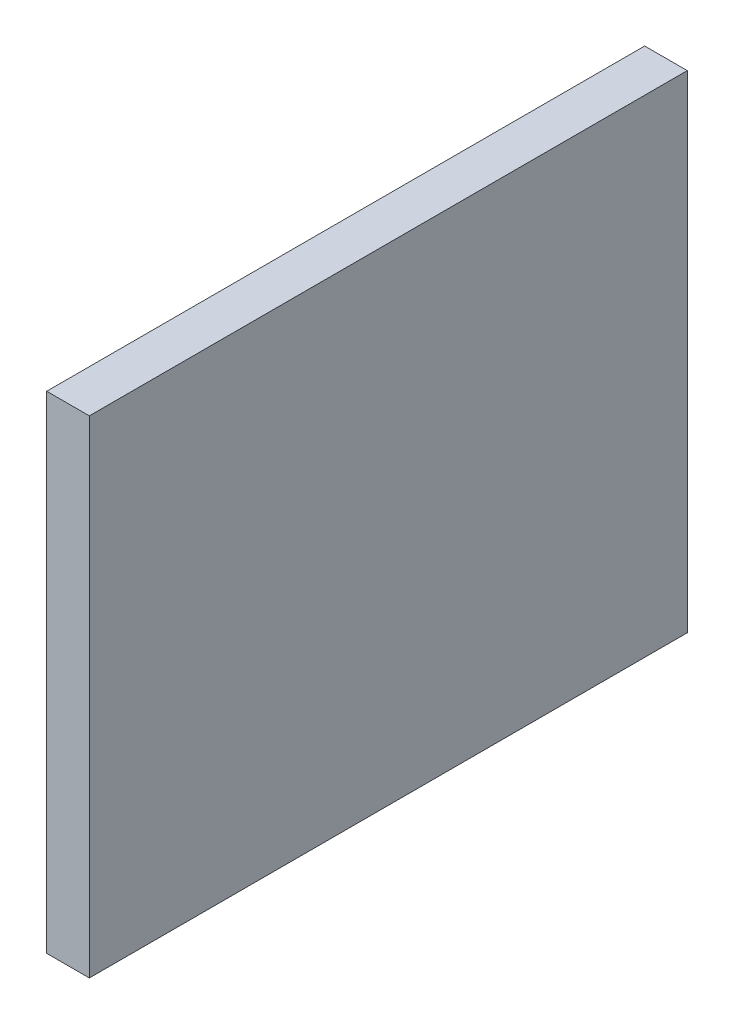
ISO-10303-21;
HEADER;
FILE_DESCRIPTION(('STEP AP214'),'2;1');
FILE_NAME('part.step','',(''),(''),'','','');
FILE_SCHEMA(('AUTOMOTIVE_DESIGN { 1 0 10303 214 1 1 1 1 }'));
ENDSEC;
DATA;
#1=APPLICATION_CONTEXT('core data for automotive mechanical design processes');
#2=APPLICATION_PROTOCOL_DEFINITION('international standard','automotive_design',2000,#1);
#3=PRODUCT_CONTEXT('',#1,'mechanical');
#4=PRODUCT('Part','Part','',(#3));
#5=PRODUCT_RELATED_PRODUCT_CATEGORY('part','',(#4));
#6=PRODUCT_DEFINITION_FORMATION('','',#4);
#7=PRODUCT_DEFINITION_CONTEXT('part definition',#1,'design');
#8=PRODUCT_DEFINITION('design','',#6,#7);
#9=PRODUCT_DEFINITION_SHAPE('','',#8);
#10=(LENGTH_UNIT() NAMED_UNIT(*) SI_UNIT(.MILLI.,.METRE.));
#11=(NAMED_UNIT(*) PLANE_ANGLE_UNIT() SI_UNIT($,.RADIAN.));
#12=(NAMED_UNIT(*) SI_UNIT($,.STERADIAN.) SOLID_ANGLE_UNIT());
#13=UNCERTAINTY_MEASURE_WITH_UNIT(LENGTH_MEASURE(1.E-05),#10,'distance_accuracy_value','');
#14=(GEOMETRIC_REPRESENTATION_CONTEXT(3) GLOBAL_UNCERTAINTY_ASSIGNED_CONTEXT((#13)) GLOBAL_UNIT_ASSIGNED_CONTEXT((#10,
#11,#12)) REPRESENTATION_CONTEXT('',''));
#15=CARTESIAN_POINT('',(0.,0.,0.));
#16=DIRECTION('',(0.,0.,1.));
#17=DIRECTION('',(1.,0.,0.));
#18=AXIS2_PLACEMENT_3D('',#15,#16,#17);
#19=CARTESIAN_POINT('',(-0.2494915,2.84949138,0.));
#20=DIRECTION('',(1.,0.,0.));
#21=DIRECTION('',(0.,0.,-1.));
#22=AXIS2_PLACEMENT_3D('',#19,#20,#21);
#23=PLANE('',#22);
#24=DIRECTION('',(0.,0.,1.));
#25=VECTOR('',#24,1.);
#26=CARTESIAN_POINT('',(-0.2494915,-2.84949138,0.));
#27=LINE('',#26,#25);
#28=CARTESIAN_POINT('',(-0.2494915,-2.84949138,0.));
#29=VERTEX_POINT('',#28);
#30=CARTESIAN_POINT('',(-0.2494915,-2.84949138,7.));
#31=VERTEX_POINT('',#30);
#32=EDGE_CURVE('E20',#29,#31,#27,.T.);
#33=ORIENTED_EDGE('',*,*,#32,.T.);
#34=DIRECTION('',(0.,1.,0.));
#35=VECTOR('',#34,1.);
#36=CARTESIAN_POINT('',(-0.2494915,-2.84949138,7.));
#37=LINE('',#36,#35);
#38=CARTESIAN_POINT('',(-0.2494915,2.84949138,7.));
#39=VERTEX_POINT('',#38);
#40=EDGE_CURVE('E55',#31,#39,#37,.T.);
#41=ORIENTED_EDGE('',*,*,#40,.T.);
#42=DIRECTION('',(0.,0.,-1.));
#43=VECTOR('',#42,1.);
#44=CARTESIAN_POINT('',(-0.2494915,2.84949138,0.));
#45=LINE('',#44,#43);
#46=CARTESIAN_POINT('',(-0.2494915,2.84949138,0.));
#47=VERTEX_POINT('',#46);
#48=EDGE_CURVE('E76',#39,#47,#45,.T.);
#49=ORIENTED_EDGE('',*,*,#48,.T.);
#50=DIRECTION('',(0.,1.,0.));
#51=VECTOR('',#50,1.);
#52=CARTESIAN_POINT('',(-0.2494915,-2.84949138,0.));
#53=LINE('',#52,#51);
#54=EDGE_CURVE('E58',#29,#47,#53,.T.);
#55=ORIENTED_EDGE('',*,*,#54,.F.);
#56=EDGE_LOOP('',(#33,#41,#49,#55));
#57=FACE_BOUND('',#56,.T.);
#58=ADVANCED_FACE('F17',(#57),#23,.F.);
#59=CARTESIAN_POINT('',(-0.2494915,-2.84949138,0.));
#60=DIRECTION('',(0.,1.,0.));
#61=DIRECTION('',(0.,0.,1.));
#62=AXIS2_PLACEMENT_3D('',#59,#60,#61);
#63=PLANE('',#62);
#64=DIRECTION('',(0.,0.,1.));
#65=VECTOR('',#64,1.);
#66=CARTESIAN_POINT('',(0.24949404,-2.84949138,0.));
#67=LINE('',#66,#65);
#68=CARTESIAN_POINT('',(0.24949404,-2.84949138,0.));
#69=VERTEX_POINT('',#68);
#70=CARTESIAN_POINT('',(0.24949404,-2.84949138,7.));
#71=VERTEX_POINT('',#70);
#72=EDGE_CURVE('E73',#69,#71,#67,.T.);
#73=ORIENTED_EDGE('',*,*,#72,.T.);
#74=DIRECTION('',(-1.,0.,0.));
#75=VECTOR('',#74,1.);
#76=CARTESIAN_POINT('',(0.24949404,-2.84949138,7.));
#77=LINE('',#76,#75);
#78=EDGE_CURVE('E63',#71,#31,#77,.T.);
#79=ORIENTED_EDGE('',*,*,#78,.T.);
#80=ORIENTED_EDGE('',*,*,#32,.F.);
#81=DIRECTION('',(-1.,0.,0.));
#82=VECTOR('',#81,1.);
#83=CARTESIAN_POINT('',(0.24949404,-2.84949138,0.));
#84=LINE('',#83,#82);
#85=EDGE_CURVE('E78',#69,#29,#84,.T.);
#86=ORIENTED_EDGE('',*,*,#85,.F.);
#87=EDGE_LOOP('',(#73,#79,#80,#86));
#88=FACE_BOUND('',#87,.T.);
#89=ADVANCED_FACE('F72',(#88),#63,.F.);
#90=CARTESIAN_POINT('',(0.24949404,-2.84949138,7.));
#91=DIRECTION('',(0.,0.,-1.));
#92=DIRECTION('',(-1.,0.,0.));
#93=AXIS2_PLACEMENT_3D('',#90,#91,#92);
#94=PLANE('',#93);
#95=DIRECTION('',(1.,0.,0.));
#96=VECTOR('',#95,1.);
#97=CARTESIAN_POINT('',(0.24949404,2.84949138,7.));
#98=LINE('',#97,#96);
#99=CARTESIAN_POINT('',(0.24949404,2.84949138,7.));
#100=VERTEX_POINT('',#99);
#101=EDGE_CURVE('E69',#100,#39,#98,.F.);
#102=ORIENTED_EDGE('',*,*,#101,.T.);
#103=ORIENTED_EDGE('',*,*,#40,.F.);
#104=ORIENTED_EDGE('',*,*,#78,.F.);
#105=DIRECTION('',(0.,1.,0.));
#106=VECTOR('',#105,1.);
#107=CARTESIAN_POINT('',(0.24949404,-2.84949138,7.));
#108=LINE('',#107,#106);
#109=EDGE_CURVE('E83',#71,#100,#108,.T.);
#110=ORIENTED_EDGE('',*,*,#109,.T.);
#111=EDGE_LOOP('',(#102,#103,#104,#110));
#112=FACE_BOUND('',#111,.T.);
#113=ADVANCED_FACE('F66',(#112),#94,.F.);
#114=CARTESIAN_POINT('',(0.24949404,2.84949138,0.));
#115=DIRECTION('',(0.,-1.,0.));
#116=DIRECTION('',(0.,0.,-1.));
#117=AXIS2_PLACEMENT_3D('',#114,#115,#116);
#118=PLANE('',#117);
#119=ORIENTED_EDGE('',*,*,#48,.F.);
#120=ORIENTED_EDGE('',*,*,#101,.F.);
#121=DIRECTION('',(0.,0.,1.));
#122=VECTOR('',#121,1.);
#123=CARTESIAN_POINT('',(0.24949404,2.84949138,0.));
#124=LINE('',#123,#122);
#125=CARTESIAN_POINT('',(0.24949404,2.84949138,0.));
#126=VERTEX_POINT('',#125);
#127=EDGE_CURVE('E26',#100,#126,#124,.F.);
#128=ORIENTED_EDGE('',*,*,#127,.T.);
#129=DIRECTION('',(-1.,0.,0.));
#130=VECTOR('',#129,1.);
#131=CARTESIAN_POINT('',(0.24949404,2.84949138,0.));
#132=LINE('',#131,#130);
#133=EDGE_CURVE('E34',#47,#126,#132,.F.);
#134=ORIENTED_EDGE('',*,*,#133,.F.);
#135=EDGE_LOOP('',(#119,#120,#128,#134));
#136=FACE_BOUND('',#135,.T.);
#137=ADVANCED_FACE('F88',(#136),#118,.F.);
#138=CARTESIAN_POINT('',(0.24949404,-2.84949138,0.));
#139=DIRECTION('',(0.,0.,-1.));
#140=DIRECTION('',(-1.,0.,0.));
#141=AXIS2_PLACEMENT_3D('',#138,#139,#140);
#142=PLANE('',#141);
#143=ORIENTED_EDGE('',*,*,#133,.T.);
#144=DIRECTION('',(0.,1.,0.));
#145=VECTOR('',#144,1.);
#146=CARTESIAN_POINT('',(0.24949404,-2.84949138,0.));
#147=LINE('',#146,#145);
#148=EDGE_CURVE('E11',#126,#69,#147,.F.);
#149=ORIENTED_EDGE('',*,*,#148,.T.);
#150=ORIENTED_EDGE('',*,*,#85,.T.);
#151=ORIENTED_EDGE('',*,*,#54,.T.);
#152=EDGE_LOOP('',(#143,#149,#150,#151));
#153=FACE_BOUND('',#152,.T.);
#154=ADVANCED_FACE('F91',(#153),#142,.T.);
#155=CARTESIAN_POINT('',(0.24949404,-2.84949138,0.));
#156=DIRECTION('',(-1.,0.,0.));
#157=DIRECTION('',(0.,0.,1.));
#158=AXIS2_PLACEMENT_3D('',#155,#156,#157);
#159=PLANE('',#158);
#160=ORIENTED_EDGE('',*,*,#127,.F.);
#161=ORIENTED_EDGE('',*,*,#109,.F.);
#162=ORIENTED_EDGE('',*,*,#72,.F.);
#163=ORIENTED_EDGE('',*,*,#148,.F.);
#164=EDGE_LOOP('',(#160,#161,#162,#163));
#165=FACE_BOUND('',#164,.T.);
#166=ADVANCED_FACE('F90',(#165),#159,.F.);
#167=CLOSED_SHELL('',(#58,#89,#113,#137,#154,#166));
#168=MANIFOLD_SOLID_BREP('B1',#167);
#169=ADVANCED_BREP_SHAPE_REPRESENTATION('',(#18,#168),#14);
#170=SHAPE_DEFINITION_REPRESENTATION(#9,#169);
ENDSEC;
END-ISO-10303-21;
